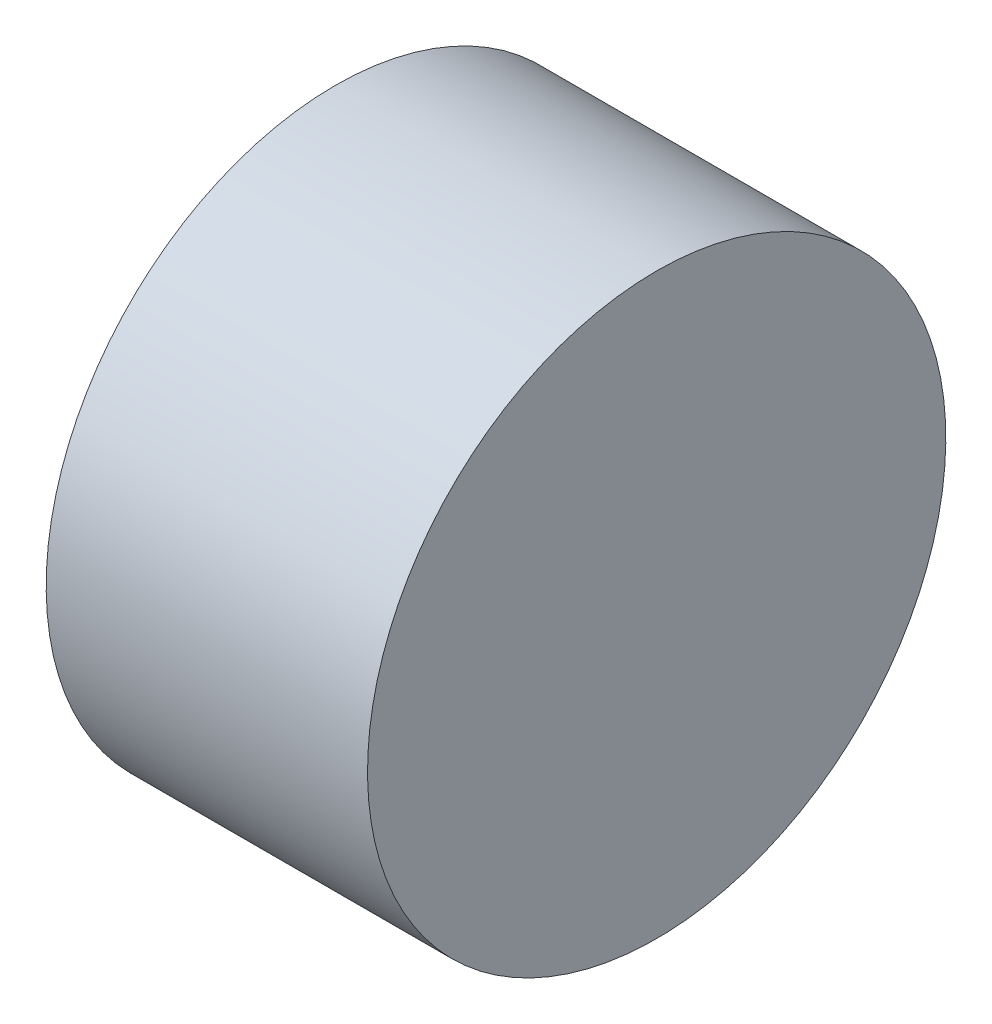
ISO-10303-21;
HEADER;
FILE_DESCRIPTION(('STEP AP214'),'2;1');
FILE_NAME('part.step','',(''),(''),'','','');
FILE_SCHEMA(('AUTOMOTIVE_DESIGN { 1 0 10303 214 1 1 1 1 }'));
ENDSEC;
DATA;
#1=APPLICATION_CONTEXT('core data for automotive mechanical design processes');
#2=APPLICATION_PROTOCOL_DEFINITION('international standard','automotive_design',2000,#1);
#3=PRODUCT_CONTEXT('',#1,'mechanical');
#4=PRODUCT('Part','Part','',(#3));
#5=PRODUCT_RELATED_PRODUCT_CATEGORY('part','',(#4));
#6=PRODUCT_DEFINITION_FORMATION('','',#4);
#7=PRODUCT_DEFINITION_CONTEXT('part definition',#1,'design');
#8=PRODUCT_DEFINITION('design','',#6,#7);
#9=PRODUCT_DEFINITION_SHAPE('','',#8);
#10=(LENGTH_UNIT() NAMED_UNIT(*) SI_UNIT(.MILLI.,.METRE.));
#11=(NAMED_UNIT(*) PLANE_ANGLE_UNIT() SI_UNIT($,.RADIAN.));
#12=(NAMED_UNIT(*) SI_UNIT($,.STERADIAN.) SOLID_ANGLE_UNIT());
#13=UNCERTAINTY_MEASURE_WITH_UNIT(LENGTH_MEASURE(1.E-05),#10,'distance_accuracy_value','');
#14=(GEOMETRIC_REPRESENTATION_CONTEXT(3) GLOBAL_UNCERTAINTY_ASSIGNED_CONTEXT((#13)) GLOBAL_UNIT_ASSIGNED_CONTEXT((#10,
#11,#12)) REPRESENTATION_CONTEXT('',''));
#15=CARTESIAN_POINT('',(0.,0.,0.));
#16=DIRECTION('',(0.,0.,1.));
#17=DIRECTION('',(1.,0.,0.));
#18=AXIS2_PLACEMENT_3D('',#15,#16,#17);
#19=CARTESIAN_POINT('',(-0.5,0.,0.));
#20=DIRECTION('',(1.,0.,0.));
#21=DIRECTION('',(0.,1.,0.));
#22=AXIS2_PLACEMENT_3D('',#19,#20,#21);
#23=CYLINDRICAL_SURFACE('',#22,0.899858507485798);
#24=CARTESIAN_POINT('',(-0.5,0.,0.));
#25=DIRECTION('',(1.,0.,0.));
#26=DIRECTION('',(0.,1.,0.));
#27=AXIS2_PLACEMENT_3D('',#24,#25,#26);
#28=CIRCLE('',#27,0.899858507485798);
#29=CARTESIAN_POINT('',(-0.5,0.899858507485798,0.));
#30=VERTEX_POINT('',#29);
#31=EDGE_CURVE('E10',#30,#30,#28,.T.);
#32=ORIENTED_EDGE('',*,*,#31,.T.);
#33=EDGE_LOOP('',(#32));
#34=FACE_BOUND('',#33,.T.);
#35=CARTESIAN_POINT('',(0.5,0.,0.));
#36=DIRECTION('',(1.,0.,0.));
#37=DIRECTION('',(0.,1.,0.));
#38=AXIS2_PLACEMENT_3D('',#35,#36,#37);
#39=CIRCLE('',#38,0.899858507485798);
#40=CARTESIAN_POINT('',(0.5,0.899858507485798,0.));
#41=VERTEX_POINT('',#40);
#42=EDGE_CURVE('E17',#41,#41,#39,.T.);
#43=ORIENTED_EDGE('',*,*,#42,.F.);
#44=EDGE_LOOP('',(#43));
#45=FACE_BOUND('',#44,.T.);
#46=ADVANCED_FACE('F14',(#34,#45),#23,.T.);
#47=CARTESIAN_POINT('',(-0.5,0.,0.));
#48=DIRECTION('',(1.,0.,0.));
#49=DIRECTION('',(0.,0.,-1.));
#50=AXIS2_PLACEMENT_3D('',#47,#48,#49);
#51=PLANE('',#50);
#52=ORIENTED_EDGE('',*,*,#31,.F.);
#53=EDGE_LOOP('',(#52));
#54=FACE_BOUND('',#53,.T.);
#55=ADVANCED_FACE('F29',(#54),#51,.F.);
#56=CARTESIAN_POINT('',(0.5,0.,0.));
#57=DIRECTION('',(1.,0.,0.));
#58=DIRECTION('',(0.,0.,-1.));
#59=AXIS2_PLACEMENT_3D('',#56,#57,#58);
#60=PLANE('',#59);
#61=ORIENTED_EDGE('',*,*,#42,.T.);
#62=EDGE_LOOP('',(#61));
#63=FACE_BOUND('',#62,.T.);
#64=ADVANCED_FACE('F26',(#63),#60,.T.);
#65=CLOSED_SHELL('',(#46,#55,#64));
#66=MANIFOLD_SOLID_BREP('B1',#65);
#67=ADVANCED_BREP_SHAPE_REPRESENTATION('',(#18,#66),#14);
#68=SHAPE_DEFINITION_REPRESENTATION(#9,#67);
ENDSEC;
END-ISO-10303-21;
